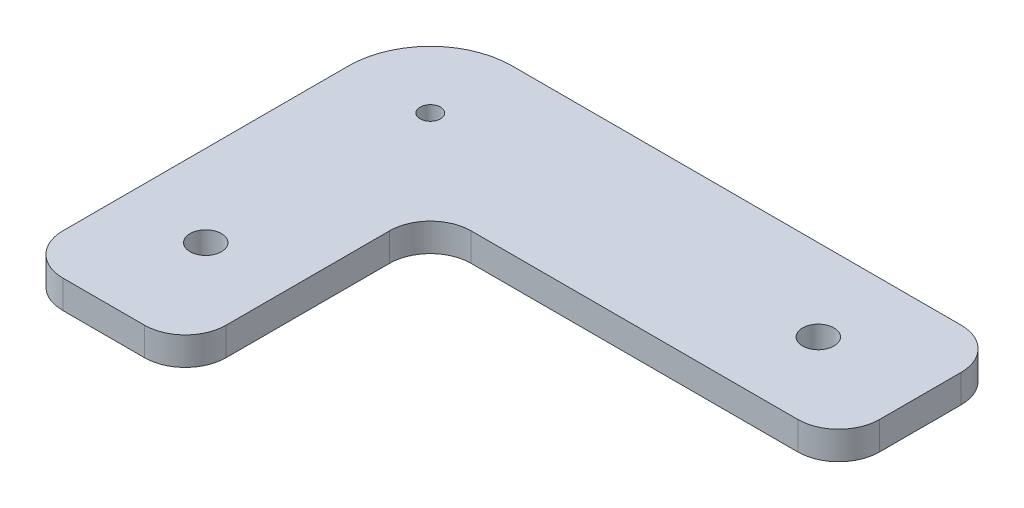
ISO-10303-21;
HEADER;
FILE_DESCRIPTION(('STEP AP214'),'2;1');
FILE_NAME('part.step','',(''),(''),'','','');
FILE_SCHEMA(('AUTOMOTIVE_DESIGN { 1 0 10303 214 1 1 1 1 }'));
ENDSEC;
DATA;
#1=APPLICATION_CONTEXT('core data for automotive mechanical design processes');
#2=APPLICATION_PROTOCOL_DEFINITION('international standard','automotive_design',2000,#1);
#3=PRODUCT_CONTEXT('',#1,'mechanical');
#4=PRODUCT('Part','Part','',(#3));
#5=PRODUCT_RELATED_PRODUCT_CATEGORY('part','',(#4));
#6=PRODUCT_DEFINITION_FORMATION('','',#4);
#7=PRODUCT_DEFINITION_CONTEXT('part definition',#1,'design');
#8=PRODUCT_DEFINITION('design','',#6,#7);
#9=PRODUCT_DEFINITION_SHAPE('','',#8);
#10=(LENGTH_UNIT() NAMED_UNIT(*) SI_UNIT(.MILLI.,.METRE.));
#11=(NAMED_UNIT(*) PLANE_ANGLE_UNIT() SI_UNIT($,.RADIAN.));
#12=(NAMED_UNIT(*) SI_UNIT($,.STERADIAN.) SOLID_ANGLE_UNIT());
#13=UNCERTAINTY_MEASURE_WITH_UNIT(LENGTH_MEASURE(1.E-05),#10,'distance_accuracy_value','');
#14=(GEOMETRIC_REPRESENTATION_CONTEXT(3) GLOBAL_UNCERTAINTY_ASSIGNED_CONTEXT((#13)) GLOBAL_UNIT_ASSIGNED_CONTEXT((#10,
#11,#12)) REPRESENTATION_CONTEXT('',''));
#15=CARTESIAN_POINT('',(0.,0.,0.));
#16=DIRECTION('',(0.,0.,1.));
#17=DIRECTION('',(1.,0.,0.));
#18=AXIS2_PLACEMENT_3D('',#15,#16,#17);
#19=CARTESIAN_POINT('',(40.,6.9,0.));
#20=DIRECTION('',(0.,0.,-1.));
#21=DIRECTION('',(-1.,0.,0.));
#22=AXIS2_PLACEMENT_3D('',#19,#20,#21);
#23=PLANE('',#22);
#24=DIRECTION('',(1.,0.,0.));
#25=VECTOR('',#24,1.);
#26=CARTESIAN_POINT('',(40.,6.9,0.));
#27=LINE('',#26,#25);
#28=CARTESIAN_POINT('',(10.,6.9,0.));
#29=VERTEX_POINT('',#28);
#30=CARTESIAN_POINT('',(30.,6.9,0.));
#31=VERTEX_POINT('',#30);
#32=EDGE_CURVE('E155',#29,#31,#27,.T.);
#33=ORIENTED_EDGE('',*,*,#32,.F.);
#34=DIRECTION('',(0.,-1.,0.));
#35=VECTOR('',#34,1.);
#36=CARTESIAN_POINT('',(10.,6.9,0.));
#37=LINE('',#36,#35);
#38=CARTESIAN_POINT('',(10.,0.,0.));
#39=VERTEX_POINT('',#38);
#40=EDGE_CURVE('E196',#29,#39,#37,.T.);
#41=ORIENTED_EDGE('',*,*,#40,.T.);
#42=DIRECTION('',(1.,0.,0.));
#43=VECTOR('',#42,1.);
#44=CARTESIAN_POINT('',(40.,0.,0.));
#45=LINE('',#44,#43);
#46=CARTESIAN_POINT('',(30.,0.,0.));
#47=VERTEX_POINT('',#46);
#48=EDGE_CURVE('E249',#39,#47,#45,.T.);
#49=ORIENTED_EDGE('',*,*,#48,.T.);
#50=DIRECTION('',(0.,-1.,0.));
#51=VECTOR('',#50,1.);
#52=CARTESIAN_POINT('',(30.,6.9,0.));
#53=LINE('',#52,#51);
#54=EDGE_CURVE('E193',#47,#31,#53,.F.);
#55=ORIENTED_EDGE('',*,*,#54,.T.);
#56=EDGE_LOOP('',(#33,#41,#49,#55));
#57=FACE_BOUND('',#56,.T.);
#58=ADVANCED_FACE('F39',(#57),#23,.F.);
#59=CARTESIAN_POINT('',(40.,6.9,-60.));
#60=DIRECTION('',(-1.,0.,0.));
#61=DIRECTION('',(0.,0.,1.));
#62=AXIS2_PLACEMENT_3D('',#59,#60,#61);
#63=PLANE('',#62);
#64=DIRECTION('',(0.,0.,-1.));
#65=VECTOR('',#64,1.);
#66=CARTESIAN_POINT('',(40.,6.9,-60.));
#67=LINE('',#66,#65);
#68=CARTESIAN_POINT('',(40.,6.9,-10.));
#69=VERTEX_POINT('',#68);
#70=CARTESIAN_POINT('',(40.,6.9,-50.));
#71=VERTEX_POINT('',#70);
#72=EDGE_CURVE('E235',#69,#71,#67,.T.);
#73=ORIENTED_EDGE('',*,*,#72,.F.);
#74=DIRECTION('',(0.,-1.,0.));
#75=VECTOR('',#74,1.);
#76=CARTESIAN_POINT('',(40.,6.9,-10.));
#77=LINE('',#76,#75);
#78=CARTESIAN_POINT('',(40.,0.,-10.));
#79=VERTEX_POINT('',#78);
#80=EDGE_CURVE('E207',#69,#79,#77,.T.);
#81=ORIENTED_EDGE('',*,*,#80,.T.);
#82=DIRECTION('',(0.,0.,-1.));
#83=VECTOR('',#82,1.);
#84=CARTESIAN_POINT('',(40.,0.,-60.));
#85=LINE('',#84,#83);
#86=CARTESIAN_POINT('',(40.,0.,-50.));
#87=VERTEX_POINT('',#86);
#88=EDGE_CURVE('E253',#79,#87,#85,.T.);
#89=ORIENTED_EDGE('',*,*,#88,.T.);
#90=DIRECTION('',(0.,-1.,0.));
#91=VECTOR('',#90,1.);
#92=CARTESIAN_POINT('',(40.,6.9,-50.));
#93=LINE('',#92,#91);
#94=EDGE_CURVE('E204',#87,#71,#93,.F.);
#95=ORIENTED_EDGE('',*,*,#94,.T.);
#96=EDGE_LOOP('',(#73,#81,#89,#95));
#97=FACE_BOUND('',#96,.T.);
#98=ADVANCED_FACE('F281',(#97),#63,.F.);
#99=CARTESIAN_POINT('',(140.,6.9,-60.));
#100=DIRECTION('',(0.,0.,-1.));
#101=DIRECTION('',(-1.,0.,0.));
#102=AXIS2_PLACEMENT_3D('',#99,#100,#101);
#103=PLANE('',#102);
#104=DIRECTION('',(1.,0.,0.));
#105=VECTOR('',#104,1.);
#106=CARTESIAN_POINT('',(140.,0.,-60.));
#107=LINE('',#106,#105);
#108=CARTESIAN_POINT('',(50.,0.,-60.));
#109=VERTEX_POINT('',#108);
#110=CARTESIAN_POINT('',(130.,0.,-60.));
#111=VERTEX_POINT('',#110);
#112=EDGE_CURVE('E157',#109,#111,#107,.T.);
#113=ORIENTED_EDGE('',*,*,#112,.T.);
#114=DIRECTION('',(0.,-1.,0.));
#115=VECTOR('',#114,1.);
#116=CARTESIAN_POINT('',(130.,6.9,-60.));
#117=LINE('',#116,#115);
#118=CARTESIAN_POINT('',(130.,6.9,-60.));
#119=VERTEX_POINT('',#118);
#120=EDGE_CURVE('E190',#111,#119,#117,.F.);
#121=ORIENTED_EDGE('',*,*,#120,.T.);
#122=DIRECTION('',(1.,0.,0.));
#123=VECTOR('',#122,1.);
#124=CARTESIAN_POINT('',(140.,6.9,-60.));
#125=LINE('',#124,#123);
#126=CARTESIAN_POINT('',(50.,6.9,-60.));
#127=VERTEX_POINT('',#126);
#128=EDGE_CURVE('E231',#127,#119,#125,.T.);
#129=ORIENTED_EDGE('',*,*,#128,.F.);
#130=DIRECTION('',(0.,-1.,0.));
#131=VECTOR('',#130,1.);
#132=CARTESIAN_POINT('',(50.,0.,-60.));
#133=LINE('',#132,#131);
#134=EDGE_CURVE('E186',#127,#109,#133,.T.);
#135=ORIENTED_EDGE('',*,*,#134,.T.);
#136=EDGE_LOOP('',(#113,#121,#129,#135));
#137=FACE_BOUND('',#136,.T.);
#138=ADVANCED_FACE('F262',(#137),#103,.F.);
#139=CARTESIAN_POINT('',(140.,6.9,-100.));
#140=DIRECTION('',(-1.,0.,0.));
#141=DIRECTION('',(0.,0.,1.));
#142=AXIS2_PLACEMENT_3D('',#139,#140,#141);
#143=PLANE('',#142);
#144=DIRECTION('',(0.,0.,-1.));
#145=VECTOR('',#144,1.);
#146=CARTESIAN_POINT('',(140.,0.,-100.));
#147=LINE('',#146,#145);
#148=CARTESIAN_POINT('',(140.,0.,-70.));
#149=VERTEX_POINT('',#148);
#150=CARTESIAN_POINT('',(140.,0.,-90.));
#151=VERTEX_POINT('',#150);
#152=EDGE_CURVE('E151',#149,#151,#147,.T.);
#153=ORIENTED_EDGE('',*,*,#152,.T.);
#154=DIRECTION('',(0.,-1.,0.));
#155=VECTOR('',#154,1.);
#156=CARTESIAN_POINT('',(140.,6.9,-90.));
#157=LINE('',#156,#155);
#158=CARTESIAN_POINT('',(140.,6.9,-90.));
#159=VERTEX_POINT('',#158);
#160=EDGE_CURVE('E134',#151,#159,#157,.F.);
#161=ORIENTED_EDGE('',*,*,#160,.T.);
#162=DIRECTION('',(0.,0.,-1.));
#163=VECTOR('',#162,1.);
#164=CARTESIAN_POINT('',(140.,6.9,-100.));
#165=LINE('',#164,#163);
#166=CARTESIAN_POINT('',(140.,6.9,-70.));
#167=VERTEX_POINT('',#166);
#168=EDGE_CURVE('E227',#167,#159,#165,.T.);
#169=ORIENTED_EDGE('',*,*,#168,.F.);
#170=DIRECTION('',(0.,-1.,0.));
#171=VECTOR('',#170,1.);
#172=CARTESIAN_POINT('',(140.,6.9,-70.));
#173=LINE('',#172,#171);
#174=EDGE_CURVE('E138',#167,#149,#173,.T.);
#175=ORIENTED_EDGE('',*,*,#174,.T.);
#176=EDGE_LOOP('',(#153,#161,#169,#175));
#177=FACE_BOUND('',#176,.T.);
#178=ADVANCED_FACE('F272',(#177),#143,.F.);
#179=CARTESIAN_POINT('',(0.,6.9,-100.));
#180=DIRECTION('',(0.,0.,1.));
#181=DIRECTION('',(1.,0.,0.));
#182=AXIS2_PLACEMENT_3D('',#179,#180,#181);
#183=PLANE('',#182);
#184=DIRECTION('',(-1.,0.,0.));
#185=VECTOR('',#184,1.);
#186=CARTESIAN_POINT('',(0.,0.,-100.));
#187=LINE('',#186,#185);
#188=CARTESIAN_POINT('',(130.,0.,-100.));
#189=VERTEX_POINT('',#188);
#190=CARTESIAN_POINT('',(20.,0.,-100.));
#191=VERTEX_POINT('',#190);
#192=EDGE_CURVE('E142',#189,#191,#187,.T.);
#193=ORIENTED_EDGE('',*,*,#192,.T.);
#194=DIRECTION('',(0.,-1.,0.));
#195=VECTOR('',#194,1.);
#196=CARTESIAN_POINT('',(20.,6.9,-100.));
#197=LINE('',#196,#195);
#198=CARTESIAN_POINT('',(20.,6.9,-100.));
#199=VERTEX_POINT('',#198);
#200=EDGE_CURVE('E48',#191,#199,#197,.F.);
#201=ORIENTED_EDGE('',*,*,#200,.T.);
#202=DIRECTION('',(-1.,0.,0.));
#203=VECTOR('',#202,1.);
#204=CARTESIAN_POINT('',(0.,6.9,-100.));
#205=LINE('',#204,#203);
#206=CARTESIAN_POINT('',(130.,6.9,-100.));
#207=VERTEX_POINT('',#206);
#208=EDGE_CURVE('E143',#207,#199,#205,.T.);
#209=ORIENTED_EDGE('',*,*,#208,.F.);
#210=DIRECTION('',(0.,-1.,0.));
#211=VECTOR('',#210,1.);
#212=CARTESIAN_POINT('',(130.,6.9,-100.));
#213=LINE('',#212,#211);
#214=EDGE_CURVE('E133',#207,#189,#213,.T.);
#215=ORIENTED_EDGE('',*,*,#214,.T.);
#216=EDGE_LOOP('',(#193,#201,#209,#215));
#217=FACE_BOUND('',#216,.T.);
#218=ADVANCED_FACE('F141',(#217),#183,.F.);
#219=CARTESIAN_POINT('',(0.,6.9,0.));
#220=DIRECTION('',(1.,0.,0.));
#221=DIRECTION('',(0.,0.,-1.));
#222=AXIS2_PLACEMENT_3D('',#219,#220,#221);
#223=PLANE('',#222);
#224=DIRECTION('',(0.,0.,1.));
#225=VECTOR('',#224,1.);
#226=CARTESIAN_POINT('',(0.,6.9,0.));
#227=LINE('',#226,#225);
#228=CARTESIAN_POINT('',(0.,6.9,-80.));
#229=VERTEX_POINT('',#228);
#230=CARTESIAN_POINT('',(0.,6.9,-10.));
#231=VERTEX_POINT('',#230);
#232=EDGE_CURVE('E146',#229,#231,#227,.T.);
#233=ORIENTED_EDGE('',*,*,#232,.F.);
#234=DIRECTION('',(0.,-1.,0.));
#235=VECTOR('',#234,1.);
#236=CARTESIAN_POINT('',(0.,6.9,-80.));
#237=LINE('',#236,#235);
#238=CARTESIAN_POINT('',(0.,0.,-80.));
#239=VERTEX_POINT('',#238);
#240=EDGE_CURVE('E217',#229,#239,#237,.T.);
#241=ORIENTED_EDGE('',*,*,#240,.T.);
#242=DIRECTION('',(0.,0.,1.));
#243=VECTOR('',#242,1.);
#244=CARTESIAN_POINT('',(0.,0.,0.));
#245=LINE('',#244,#243);
#246=CARTESIAN_POINT('',(0.,0.,-10.));
#247=VERTEX_POINT('',#246);
#248=EDGE_CURVE('E150',#239,#247,#245,.T.);
#249=ORIENTED_EDGE('',*,*,#248,.T.);
#250=DIRECTION('',(0.,-1.,0.));
#251=VECTOR('',#250,1.);
#252=CARTESIAN_POINT('',(0.,6.9,-10.));
#253=LINE('',#252,#251);
#254=EDGE_CURVE('E200',#247,#231,#253,.F.);
#255=ORIENTED_EDGE('',*,*,#254,.T.);
#256=EDGE_LOOP('',(#233,#241,#249,#255));
#257=FACE_BOUND('',#256,.T.);
#258=ADVANCED_FACE('F279',(#257),#223,.F.);
#259=CARTESIAN_POINT('',(0.,6.9,0.));
#260=DIRECTION('',(0.,-1.,0.));
#261=DIRECTION('',(0.,0.,-1.));
#262=AXIS2_PLACEMENT_3D('',#259,#260,#261);
#263=PLANE('',#262);
#264=CARTESIAN_POINT('',(20.,6.9,-25.));
#265=DIRECTION('',(0.,1.,0.));
#266=DIRECTION('',(0.,0.,1.));
#267=AXIS2_PLACEMENT_3D('',#264,#265,#266);
#268=CIRCLE('',#267,3.85);
#269=CARTESIAN_POINT('',(20.,6.9,-21.15));
#270=VERTEX_POINT('',#269);
#271=EDGE_CURVE('E354',#270,#270,#268,.T.);
#272=ORIENTED_EDGE('',*,*,#271,.F.);
#273=EDGE_LOOP('',(#272));
#274=FACE_BOUND('',#273,.T.);
#275=CARTESIAN_POINT('',(115.,6.9,-80.));
#276=DIRECTION('',(0.,1.,0.));
#277=DIRECTION('',(0.,0.,1.));
#278=AXIS2_PLACEMENT_3D('',#275,#276,#277);
#279=CIRCLE('',#278,3.85);
#280=CARTESIAN_POINT('',(115.,6.9,-76.15));
#281=VERTEX_POINT('',#280);
#282=EDGE_CURVE('E362',#281,#281,#279,.T.);
#283=ORIENTED_EDGE('',*,*,#282,.F.);
#284=EDGE_LOOP('',(#283));
#285=FACE_BOUND('',#284,.T.);
#286=CARTESIAN_POINT('',(20.,6.9,-80.));
#287=DIRECTION('',(0.,1.,0.));
#288=DIRECTION('',(0.,0.,1.));
#289=AXIS2_PLACEMENT_3D('',#286,#287,#288);
#290=CIRCLE('',#289,2.5);
#291=CARTESIAN_POINT('',(20.,6.9,-77.5));
#292=VERTEX_POINT('',#291);
#293=EDGE_CURVE('E246',#292,#292,#290,.T.);
#294=ORIENTED_EDGE('',*,*,#293,.F.);
#295=EDGE_LOOP('',(#294));
#296=FACE_BOUND('',#295,.T.);
#297=ORIENTED_EDGE('',*,*,#208,.T.);
#298=CARTESIAN_POINT('',(20.,6.9,-80.));
#299=DIRECTION('',(0.,-1.,0.));
#300=DIRECTION('',(0.,0.,-1.));
#301=AXIS2_PLACEMENT_3D('',#298,#299,#300);
#302=CIRCLE('',#301,20.);
#303=EDGE_CURVE('E11',#199,#229,#302,.F.);
#304=ORIENTED_EDGE('',*,*,#303,.T.);
#305=ORIENTED_EDGE('',*,*,#232,.T.);
#306=CARTESIAN_POINT('',(10.,6.9,-10.));
#307=DIRECTION('',(0.,-1.,0.));
#308=DIRECTION('',(0.,0.,-1.));
#309=AXIS2_PLACEMENT_3D('',#306,#307,#308);
#310=CIRCLE('',#309,10.);
#311=EDGE_CURVE('E177',#231,#29,#310,.F.);
#312=ORIENTED_EDGE('',*,*,#311,.T.);
#313=ORIENTED_EDGE('',*,*,#32,.T.);
#314=CARTESIAN_POINT('',(30.,6.9,-10.));
#315=DIRECTION('',(0.,-1.,0.));
#316=DIRECTION('',(0.,0.,-1.));
#317=AXIS2_PLACEMENT_3D('',#314,#315,#316);
#318=CIRCLE('',#317,10.);
#319=EDGE_CURVE('E174',#31,#69,#318,.F.);
#320=ORIENTED_EDGE('',*,*,#319,.T.);
#321=ORIENTED_EDGE('',*,*,#72,.T.);
#322=CARTESIAN_POINT('',(50.,6.9,-50.));
#323=DIRECTION('',(0.,-1.,0.));
#324=DIRECTION('',(0.,0.,-1.));
#325=AXIS2_PLACEMENT_3D('',#322,#323,#324);
#326=CIRCLE('',#325,10.);
#327=EDGE_CURVE('E214',#71,#127,#326,.T.);
#328=ORIENTED_EDGE('',*,*,#327,.T.);
#329=ORIENTED_EDGE('',*,*,#128,.T.);
#330=CARTESIAN_POINT('',(130.,6.9,-70.));
#331=DIRECTION('',(0.,-1.,0.));
#332=DIRECTION('',(0.,0.,-1.));
#333=AXIS2_PLACEMENT_3D('',#330,#331,#332);
#334=CIRCLE('',#333,10.);
#335=EDGE_CURVE('E180',#119,#167,#334,.F.);
#336=ORIENTED_EDGE('',*,*,#335,.T.);
#337=ORIENTED_EDGE('',*,*,#168,.T.);
#338=CARTESIAN_POINT('',(130.,6.9,-90.));
#339=DIRECTION('',(0.,-1.,0.));
#340=DIRECTION('',(0.,0.,-1.));
#341=AXIS2_PLACEMENT_3D('',#338,#339,#340);
#342=CIRCLE('',#341,10.);
#343=EDGE_CURVE('E183',#159,#207,#342,.F.);
#344=ORIENTED_EDGE('',*,*,#343,.T.);
#345=EDGE_LOOP('',(#297,#304,#305,#312,#313,#320,#321,#328,#329,#336,#337,#344));
#346=FACE_BOUND('',#345,.T.);
#347=ADVANCED_FACE('F270',(#274,#285,#296,#346),#263,.F.);
#348=CARTESIAN_POINT('',(0.,0.,0.));
#349=DIRECTION('',(0.,-1.,0.));
#350=DIRECTION('',(0.,0.,-1.));
#351=AXIS2_PLACEMENT_3D('',#348,#349,#350);
#352=PLANE('',#351);
#353=CARTESIAN_POINT('',(20.,0.,-25.));
#354=DIRECTION('',(0.,1.,0.));
#355=DIRECTION('',(0.,0.,1.));
#356=AXIS2_PLACEMENT_3D('',#353,#354,#355);
#357=CIRCLE('',#356,3.85);
#358=CARTESIAN_POINT('',(20.,0.,-21.15));
#359=VERTEX_POINT('',#358);
#360=EDGE_CURVE('E351',#359,#359,#357,.T.);
#361=ORIENTED_EDGE('',*,*,#360,.T.);
#362=EDGE_LOOP('',(#361));
#363=FACE_BOUND('',#362,.T.);
#364=CARTESIAN_POINT('',(115.,0.,-80.));
#365=DIRECTION('',(0.,1.,0.));
#366=DIRECTION('',(0.,0.,1.));
#367=AXIS2_PLACEMENT_3D('',#364,#365,#366);
#368=CIRCLE('',#367,3.85);
#369=CARTESIAN_POINT('',(115.,0.,-76.15));
#370=VERTEX_POINT('',#369);
#371=EDGE_CURVE('E356',#370,#370,#368,.T.);
#372=ORIENTED_EDGE('',*,*,#371,.T.);
#373=EDGE_LOOP('',(#372));
#374=FACE_BOUND('',#373,.T.);
#375=CARTESIAN_POINT('',(20.,0.,-80.));
#376=DIRECTION('',(0.,1.,0.));
#377=DIRECTION('',(0.,0.,1.));
#378=AXIS2_PLACEMENT_3D('',#375,#376,#377);
#379=CIRCLE('',#378,2.5);
#380=CARTESIAN_POINT('',(20.,0.,-77.5));
#381=VERTEX_POINT('',#380);
#382=EDGE_CURVE('E254',#381,#381,#379,.T.);
#383=ORIENTED_EDGE('',*,*,#382,.T.);
#384=EDGE_LOOP('',(#383));
#385=FACE_BOUND('',#384,.T.);
#386=ORIENTED_EDGE('',*,*,#248,.F.);
#387=CARTESIAN_POINT('',(20.,0.,-80.));
#388=DIRECTION('',(0.,-1.,0.));
#389=DIRECTION('',(0.,0.,-1.));
#390=AXIS2_PLACEMENT_3D('',#387,#388,#389);
#391=CIRCLE('',#390,20.);
#392=EDGE_CURVE('E62',#239,#191,#391,.T.);
#393=ORIENTED_EDGE('',*,*,#392,.T.);
#394=ORIENTED_EDGE('',*,*,#192,.F.);
#395=CARTESIAN_POINT('',(130.,0.,-90.));
#396=DIRECTION('',(0.,-1.,0.));
#397=DIRECTION('',(0.,0.,-1.));
#398=AXIS2_PLACEMENT_3D('',#395,#396,#397);
#399=CIRCLE('',#398,10.);
#400=EDGE_CURVE('E129',#189,#151,#399,.T.);
#401=ORIENTED_EDGE('',*,*,#400,.T.);
#402=ORIENTED_EDGE('',*,*,#152,.F.);
#403=CARTESIAN_POINT('',(130.,0.,-70.));
#404=DIRECTION('',(0.,-1.,0.));
#405=DIRECTION('',(0.,0.,-1.));
#406=AXIS2_PLACEMENT_3D('',#403,#404,#405);
#407=CIRCLE('',#406,10.);
#408=EDGE_CURVE('E139',#149,#111,#407,.T.);
#409=ORIENTED_EDGE('',*,*,#408,.T.);
#410=ORIENTED_EDGE('',*,*,#112,.F.);
#411=CARTESIAN_POINT('',(50.,0.,-50.));
#412=DIRECTION('',(0.,-1.,0.));
#413=DIRECTION('',(0.,0.,-1.));
#414=AXIS2_PLACEMENT_3D('',#411,#412,#413);
#415=CIRCLE('',#414,10.);
#416=EDGE_CURVE('E211',#109,#87,#415,.F.);
#417=ORIENTED_EDGE('',*,*,#416,.T.);
#418=ORIENTED_EDGE('',*,*,#88,.F.);
#419=CARTESIAN_POINT('',(30.,0.,-10.));
#420=DIRECTION('',(0.,-1.,0.));
#421=DIRECTION('',(0.,0.,-1.));
#422=AXIS2_PLACEMENT_3D('',#419,#420,#421);
#423=CIRCLE('',#422,10.);
#424=EDGE_CURVE('E145',#79,#47,#423,.T.);
#425=ORIENTED_EDGE('',*,*,#424,.T.);
#426=ORIENTED_EDGE('',*,*,#48,.F.);
#427=CARTESIAN_POINT('',(10.,0.,-10.));
#428=DIRECTION('',(0.,-1.,0.));
#429=DIRECTION('',(0.,0.,-1.));
#430=AXIS2_PLACEMENT_3D('',#427,#428,#429);
#431=CIRCLE('',#430,10.);
#432=EDGE_CURVE('E163',#39,#247,#431,.T.);
#433=ORIENTED_EDGE('',*,*,#432,.T.);
#434=EDGE_LOOP('',(#386,#393,#394,#401,#402,#409,#410,#417,#418,#425,#426,#433));
#435=FACE_BOUND('',#434,.T.);
#436=ADVANCED_FACE('F148',(#363,#374,#385,#435),#352,.T.);
#437=CARTESIAN_POINT('',(130.,6.9,-90.));
#438=DIRECTION('',(0.,-1.,0.));
#439=DIRECTION('',(0.,0.,-1.));
#440=AXIS2_PLACEMENT_3D('',#437,#438,#439);
#441=CYLINDRICAL_SURFACE('',#440,10.);
#442=ORIENTED_EDGE('',*,*,#343,.F.);
#443=ORIENTED_EDGE('',*,*,#160,.F.);
#444=ORIENTED_EDGE('',*,*,#400,.F.);
#445=ORIENTED_EDGE('',*,*,#214,.F.);
#446=EDGE_LOOP('',(#442,#443,#444,#445));
#447=FACE_BOUND('',#446,.T.);
#448=ADVANCED_FACE('F132',(#447),#441,.T.);
#449=CARTESIAN_POINT('',(130.,6.9,-70.));
#450=DIRECTION('',(0.,-1.,0.));
#451=DIRECTION('',(0.,0.,-1.));
#452=AXIS2_PLACEMENT_3D('',#449,#450,#451);
#453=CYLINDRICAL_SURFACE('',#452,10.);
#454=ORIENTED_EDGE('',*,*,#335,.F.);
#455=ORIENTED_EDGE('',*,*,#120,.F.);
#456=ORIENTED_EDGE('',*,*,#408,.F.);
#457=ORIENTED_EDGE('',*,*,#174,.F.);
#458=EDGE_LOOP('',(#454,#455,#456,#457));
#459=FACE_BOUND('',#458,.T.);
#460=ADVANCED_FACE('F267',(#459),#453,.T.);
#461=CARTESIAN_POINT('',(10.,6.9,-10.));
#462=DIRECTION('',(0.,-1.,0.));
#463=DIRECTION('',(0.,0.,-1.));
#464=AXIS2_PLACEMENT_3D('',#461,#462,#463);
#465=CYLINDRICAL_SURFACE('',#464,10.);
#466=ORIENTED_EDGE('',*,*,#311,.F.);
#467=ORIENTED_EDGE('',*,*,#254,.F.);
#468=ORIENTED_EDGE('',*,*,#432,.F.);
#469=ORIENTED_EDGE('',*,*,#40,.F.);
#470=EDGE_LOOP('',(#466,#467,#468,#469));
#471=FACE_BOUND('',#470,.T.);
#472=ADVANCED_FACE('F296',(#471),#465,.T.);
#473=CARTESIAN_POINT('',(30.,6.9,-10.));
#474=DIRECTION('',(0.,-1.,0.));
#475=DIRECTION('',(0.,0.,-1.));
#476=AXIS2_PLACEMENT_3D('',#473,#474,#475);
#477=CYLINDRICAL_SURFACE('',#476,10.);
#478=ORIENTED_EDGE('',*,*,#319,.F.);
#479=ORIENTED_EDGE('',*,*,#54,.F.);
#480=ORIENTED_EDGE('',*,*,#424,.F.);
#481=ORIENTED_EDGE('',*,*,#80,.F.);
#482=EDGE_LOOP('',(#478,#479,#480,#481));
#483=FACE_BOUND('',#482,.T.);
#484=ADVANCED_FACE('F299',(#483),#477,.T.);
#485=CARTESIAN_POINT('',(50.,6.9,-50.));
#486=DIRECTION('',(0.,1.,0.));
#487=DIRECTION('',(0.,0.,1.));
#488=AXIS2_PLACEMENT_3D('',#485,#486,#487);
#489=CYLINDRICAL_SURFACE('',#488,10.);
#490=ORIENTED_EDGE('',*,*,#327,.F.);
#491=ORIENTED_EDGE('',*,*,#94,.F.);
#492=ORIENTED_EDGE('',*,*,#416,.F.);
#493=ORIENTED_EDGE('',*,*,#134,.F.);
#494=EDGE_LOOP('',(#490,#491,#492,#493));
#495=FACE_BOUND('',#494,.T.);
#496=ADVANCED_FACE('F302',(#495),#489,.F.);
#497=CARTESIAN_POINT('',(20.,6.9,-80.));
#498=DIRECTION('',(0.,-1.,0.));
#499=DIRECTION('',(0.,0.,-1.));
#500=AXIS2_PLACEMENT_3D('',#497,#498,#499);
#501=CYLINDRICAL_SURFACE('',#500,20.);
#502=ORIENTED_EDGE('',*,*,#303,.F.);
#503=ORIENTED_EDGE('',*,*,#200,.F.);
#504=ORIENTED_EDGE('',*,*,#392,.F.);
#505=ORIENTED_EDGE('',*,*,#240,.F.);
#506=EDGE_LOOP('',(#502,#503,#504,#505));
#507=FACE_BOUND('',#506,.T.);
#508=ADVANCED_FACE('F41',(#507),#501,.T.);
#509=CARTESIAN_POINT('',(20.,0.,-80.));
#510=DIRECTION('',(0.,1.,0.));
#511=DIRECTION('',(0.,0.,1.));
#512=AXIS2_PLACEMENT_3D('',#509,#510,#511);
#513=CYLINDRICAL_SURFACE('',#512,2.5);
#514=ORIENTED_EDGE('',*,*,#382,.F.);
#515=EDGE_LOOP('',(#514));
#516=FACE_BOUND('',#515,.T.);
#517=ORIENTED_EDGE('',*,*,#293,.T.);
#518=EDGE_LOOP('',(#517));
#519=FACE_BOUND('',#518,.T.);
#520=ADVANCED_FACE('F309',(#516,#519),#513,.F.);
#521=CARTESIAN_POINT('',(115.,0.,-80.));
#522=DIRECTION('',(0.,1.,0.));
#523=DIRECTION('',(0.,0.,1.));
#524=AXIS2_PLACEMENT_3D('',#521,#522,#523);
#525=CYLINDRICAL_SURFACE('',#524,3.85);
#526=ORIENTED_EDGE('',*,*,#371,.F.);
#527=EDGE_LOOP('',(#526));
#528=FACE_BOUND('',#527,.T.);
#529=ORIENTED_EDGE('',*,*,#282,.T.);
#530=EDGE_LOOP('',(#529));
#531=FACE_BOUND('',#530,.T.);
#532=ADVANCED_FACE('F338',(#528,#531),#525,.F.);
#533=CARTESIAN_POINT('',(20.,0.,-25.));
#534=DIRECTION('',(0.,1.,0.));
#535=DIRECTION('',(0.,0.,1.));
#536=AXIS2_PLACEMENT_3D('',#533,#534,#535);
#537=CYLINDRICAL_SURFACE('',#536,3.85);
#538=ORIENTED_EDGE('',*,*,#360,.F.);
#539=EDGE_LOOP('',(#538));
#540=FACE_BOUND('',#539,.T.);
#541=ORIENTED_EDGE('',*,*,#271,.T.);
#542=EDGE_LOOP('',(#541));
#543=FACE_BOUND('',#542,.T.);
#544=ADVANCED_FACE('F342',(#540,#543),#537,.F.);
#545=CLOSED_SHELL('',(#58,#98,#138,#178,#218,#258,#347,#436,#448,#460,#472,#484,#496,#508,#520,
#532,#544));
#546=MANIFOLD_SOLID_BREP('B2',#545);
#547=ADVANCED_BREP_SHAPE_REPRESENTATION('',(#18,#546),#14);
#548=SHAPE_DEFINITION_REPRESENTATION(#9,#547);
ENDSEC;
END-ISO-10303-21;
